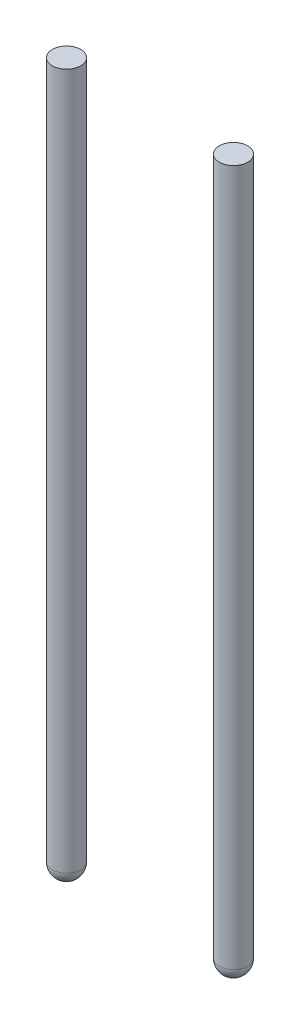
ISO-10303-21;
HEADER;
FILE_DESCRIPTION(('STEP AP214'),'2;1');
FILE_NAME('part.step','',(''),(''),'','','');
FILE_SCHEMA(('AUTOMOTIVE_DESIGN { 1 0 10303 214 1 1 1 1 }'));
ENDSEC;
DATA;
#1=APPLICATION_CONTEXT('core data for automotive mechanical design processes');
#2=APPLICATION_PROTOCOL_DEFINITION('international standard','automotive_design',2000,#1);
#3=PRODUCT_CONTEXT('',#1,'mechanical');
#4=PRODUCT('Part','Part','',(#3));
#5=PRODUCT_RELATED_PRODUCT_CATEGORY('part','',(#4));
#6=PRODUCT_DEFINITION_FORMATION('','',#4);
#7=PRODUCT_DEFINITION_CONTEXT('part definition',#1,'design');
#8=PRODUCT_DEFINITION('design','',#6,#7);
#9=PRODUCT_DEFINITION_SHAPE('','',#8);
#10=(LENGTH_UNIT() NAMED_UNIT(*) SI_UNIT(.MILLI.,.METRE.));
#11=(NAMED_UNIT(*) PLANE_ANGLE_UNIT() SI_UNIT($,.RADIAN.));
#12=(NAMED_UNIT(*) SI_UNIT($,.STERADIAN.) SOLID_ANGLE_UNIT());
#13=UNCERTAINTY_MEASURE_WITH_UNIT(LENGTH_MEASURE(1.E-05),#10,'distance_accuracy_value','');
#14=(GEOMETRIC_REPRESENTATION_CONTEXT(3) GLOBAL_UNCERTAINTY_ASSIGNED_CONTEXT((#13)) GLOBAL_UNIT_ASSIGNED_CONTEXT((#10,
#11,#12)) REPRESENTATION_CONTEXT('',''));
#15=CARTESIAN_POINT('',(0.,0.,0.));
#16=DIRECTION('',(0.,0.,1.));
#17=DIRECTION('',(1.,0.,0.));
#18=AXIS2_PLACEMENT_3D('',#15,#16,#17);
#19=CARTESIAN_POINT('',(-1.175,-10.,0.));
#20=DIRECTION('',(0.,1.,0.));
#21=DIRECTION('',(0.,0.,1.));
#22=AXIS2_PLACEMENT_3D('',#19,#20,#21);
#23=CYLINDRICAL_SURFACE('',#22,0.2);
#24=CARTESIAN_POINT('',(-1.175,-9.8,0.));
#25=DIRECTION('',(0.,1.,0.));
#26=DIRECTION('',(0.,0.,1.));
#27=AXIS2_PLACEMENT_3D('',#24,#25,#26);
#28=CIRCLE('',#27,0.2);
#29=CARTESIAN_POINT('',(-1.175,-9.8,0.2));
#30=VERTEX_POINT('',#29);
#31=EDGE_CURVE('E11',#30,#30,#28,.T.);
#32=ORIENTED_EDGE('',*,*,#31,.T.);
#33=EDGE_LOOP('',(#32));
#34=FACE_BOUND('',#33,.T.);
#35=CARTESIAN_POINT('',(-1.175,0.,0.));
#36=DIRECTION('',(0.,1.,0.));
#37=DIRECTION('',(0.,0.,1.));
#38=AXIS2_PLACEMENT_3D('',#35,#36,#37);
#39=CIRCLE('',#38,0.2);
#40=CARTESIAN_POINT('',(-1.175,0.,0.2));
#41=VERTEX_POINT('',#40);
#42=EDGE_CURVE('E52',#41,#41,#39,.T.);
#43=ORIENTED_EDGE('',*,*,#42,.F.);
#44=EDGE_LOOP('',(#43));
#45=FACE_BOUND('',#44,.T.);
#46=ADVANCED_FACE('F44',(#34,#45),#23,.T.);
#47=CARTESIAN_POINT('',(-1.175,0.,0.));
#48=DIRECTION('',(0.,1.,0.));
#49=DIRECTION('',(0.,0.,1.));
#50=AXIS2_PLACEMENT_3D('',#47,#48,#49);
#51=PLANE('',#50);
#52=ORIENTED_EDGE('',*,*,#42,.T.);
#53=EDGE_LOOP('',(#52));
#54=FACE_BOUND('',#53,.T.);
#55=ADVANCED_FACE('F59',(#54),#51,.T.);
#56=CARTESIAN_POINT('',(-1.175,-9.8,0.));
#57=DIRECTION('',(0.,1.,0.));
#58=DIRECTION('',(0.,0.,1.));
#59=AXIS2_PLACEMENT_3D('',#56,#57,#58);
#60=SPHERICAL_SURFACE('',#59,0.2);
#61=ORIENTED_EDGE('',*,*,#31,.F.);
#62=EDGE_LOOP('',(#61));
#63=FACE_BOUND('',#62,.T.);
#64=ADVANCED_FACE('F46',(#63),#60,.T.);
#65=CLOSED_SHELL('',(#46,#55,#64));
#66=MANIFOLD_SOLID_BREP('B2',#65);
#67=CARTESIAN_POINT('',(1.175,-10.,0.));
#68=DIRECTION('',(0.,1.,0.));
#69=DIRECTION('',(0.,0.,1.));
#70=AXIS2_PLACEMENT_3D('',#67,#68,#69);
#71=CYLINDRICAL_SURFACE('',#70,0.2);
#72=CARTESIAN_POINT('',(1.175,-9.8,0.));
#73=DIRECTION('',(0.,1.,0.));
#74=DIRECTION('',(0.,0.,1.));
#75=AXIS2_PLACEMENT_3D('',#72,#73,#74);
#76=CIRCLE('',#75,0.2);
#77=CARTESIAN_POINT('',(1.175,-9.8,0.2));
#78=VERTEX_POINT('',#77);
#79=EDGE_CURVE('E43',#78,#78,#76,.T.);
#80=ORIENTED_EDGE('',*,*,#79,.T.);
#81=EDGE_LOOP('',(#80));
#82=FACE_BOUND('',#81,.T.);
#83=CARTESIAN_POINT('',(1.175,0.,0.));
#84=DIRECTION('',(0.,1.,0.));
#85=DIRECTION('',(0.,0.,1.));
#86=AXIS2_PLACEMENT_3D('',#83,#84,#85);
#87=CIRCLE('',#86,0.2);
#88=CARTESIAN_POINT('',(1.175,0.,0.2));
#89=VERTEX_POINT('',#88);
#90=EDGE_CURVE('E93',#89,#89,#87,.T.);
#91=ORIENTED_EDGE('',*,*,#90,.F.);
#92=EDGE_LOOP('',(#91));
#93=FACE_BOUND('',#92,.T.);
#94=ADVANCED_FACE('F86',(#82,#93),#71,.T.);
#95=CARTESIAN_POINT('',(1.175,0.,0.));
#96=DIRECTION('',(0.,1.,0.));
#97=DIRECTION('',(0.,0.,1.));
#98=AXIS2_PLACEMENT_3D('',#95,#96,#97);
#99=PLANE('',#98);
#100=ORIENTED_EDGE('',*,*,#90,.T.);
#101=EDGE_LOOP('',(#100));
#102=FACE_BOUND('',#101,.T.);
#103=ADVANCED_FACE('F99',(#102),#99,.T.);
#104=CARTESIAN_POINT('',(1.175,-9.8,0.));
#105=DIRECTION('',(0.,1.,0.));
#106=DIRECTION('',(0.,0.,1.));
#107=AXIS2_PLACEMENT_3D('',#104,#105,#106);
#108=SPHERICAL_SURFACE('',#107,0.2);
#109=ORIENTED_EDGE('',*,*,#79,.F.);
#110=EDGE_LOOP('',(#109));
#111=FACE_BOUND('',#110,.T.);
#112=ADVANCED_FACE('F88',(#111),#108,.T.);
#113=CLOSED_SHELL('',(#94,#103,#112));
#114=MANIFOLD_SOLID_BREP('B6',#113);
#115=ADVANCED_BREP_SHAPE_REPRESENTATION('',(#18,#66,#114),#14);
#116=SHAPE_DEFINITION_REPRESENTATION(#9,#115);
ENDSEC;
END-ISO-10303-21;
